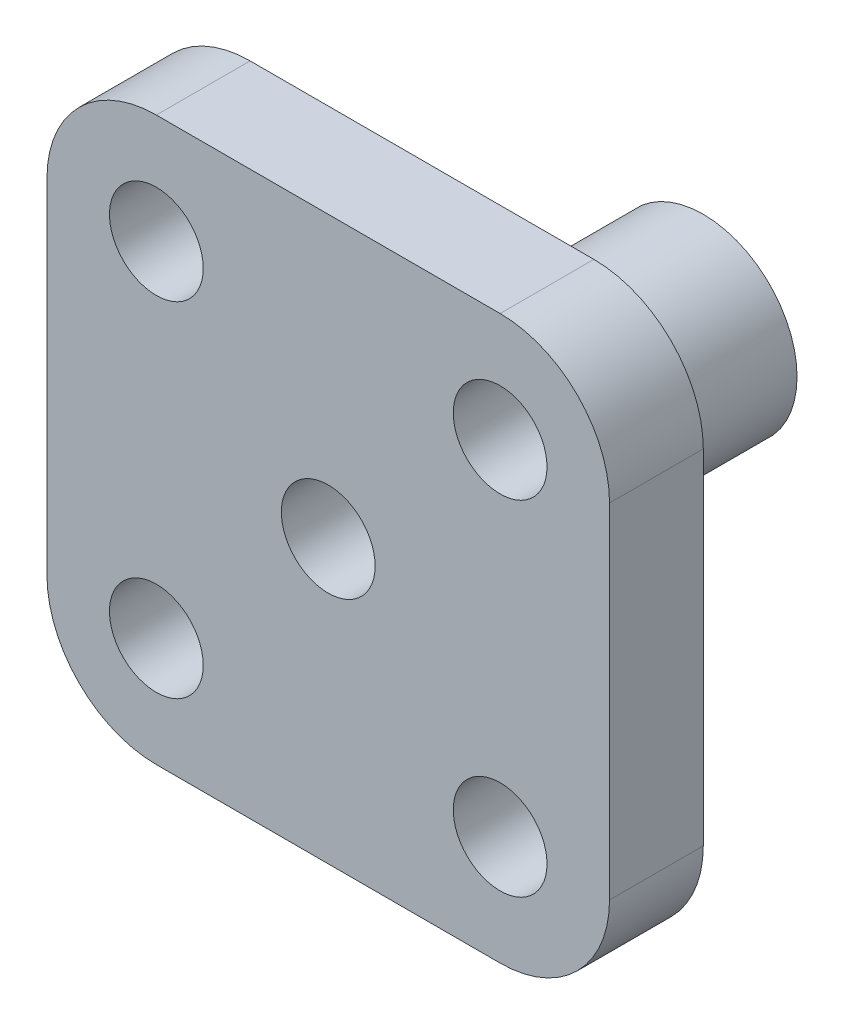
ISO-10303-21;
HEADER;
FILE_DESCRIPTION(('STEP AP214'),'2;1');
FILE_NAME('part.step','',(''),(''),'','','');
FILE_SCHEMA(('AUTOMOTIVE_DESIGN { 1 0 10303 214 1 1 1 1 }'));
ENDSEC;
DATA;
#1=APPLICATION_CONTEXT('core data for automotive mechanical design processes');
#2=APPLICATION_PROTOCOL_DEFINITION('international standard','automotive_design',2000,#1);
#3=PRODUCT_CONTEXT('',#1,'mechanical');
#4=PRODUCT('Part','Part','',(#3));
#5=PRODUCT_RELATED_PRODUCT_CATEGORY('part','',(#4));
#6=PRODUCT_DEFINITION_FORMATION('','',#4);
#7=PRODUCT_DEFINITION_CONTEXT('part definition',#1,'design');
#8=PRODUCT_DEFINITION('design','',#6,#7);
#9=PRODUCT_DEFINITION_SHAPE('','',#8);
#10=(LENGTH_UNIT() NAMED_UNIT(*) SI_UNIT(.MILLI.,.METRE.));
#11=(NAMED_UNIT(*) PLANE_ANGLE_UNIT() SI_UNIT($,.RADIAN.));
#12=(NAMED_UNIT(*) SI_UNIT($,.STERADIAN.) SOLID_ANGLE_UNIT());
#13=UNCERTAINTY_MEASURE_WITH_UNIT(LENGTH_MEASURE(1.E-05),#10,'distance_accuracy_value','');
#14=(GEOMETRIC_REPRESENTATION_CONTEXT(3) GLOBAL_UNCERTAINTY_ASSIGNED_CONTEXT((#13)) GLOBAL_UNIT_ASSIGNED_CONTEXT((#10,
#11,#12)) REPRESENTATION_CONTEXT('',''));
#15=CARTESIAN_POINT('',(0.,0.,0.));
#16=DIRECTION('',(0.,0.,1.));
#17=DIRECTION('',(1.,0.,0.));
#18=AXIS2_PLACEMENT_3D('',#15,#16,#17);
#19=CARTESIAN_POINT('',(0.,0.,-2.25));
#20=DIRECTION('',(0.,0.,1.));
#21=DIRECTION('',(1.,0.,0.));
#22=AXIS2_PLACEMENT_3D('',#19,#20,#21);
#23=PLANE('',#22);
#24=CARTESIAN_POINT('',(0.,0.,-2.25));
#25=DIRECTION('',(0.,0.,-1.));
#26=DIRECTION('',(-1.,0.,0.));
#27=AXIS2_PLACEMENT_3D('',#24,#25,#26);
#28=CIRCLE('',#27,0.65625);
#29=CARTESIAN_POINT('',(-0.65625,0.,-2.25));
#30=VERTEX_POINT('',#29);
#31=EDGE_CURVE('E214',#30,#30,#28,.T.);
#32=ORIENTED_EDGE('',*,*,#31,.F.);
#33=EDGE_LOOP('',(#32));
#34=FACE_BOUND('',#33,.T.);
#35=CARTESIAN_POINT('',(0.,0.,-2.25));
#36=DIRECTION('',(0.,0.,-1.));
#37=DIRECTION('',(-1.,0.,0.));
#38=AXIS2_PLACEMENT_3D('',#35,#36,#37);
#39=CIRCLE('',#38,0.75);
#40=CARTESIAN_POINT('',(-0.75,0.,-2.25));
#41=VERTEX_POINT('',#40);
#42=EDGE_CURVE('E135',#41,#41,#39,.T.);
#43=ORIENTED_EDGE('',*,*,#42,.T.);
#44=EDGE_LOOP('',(#43));
#45=FACE_BOUND('',#44,.T.);
#46=ADVANCED_FACE('F33',(#34,#45),#23,.F.);
#47=CARTESIAN_POINT('',(0.,0.,-2.88391304347826));
#48=DIRECTION('',(0.,0.,-1.));
#49=DIRECTION('',(-1.,0.,0.));
#50=AXIS2_PLACEMENT_3D('',#47,#48,#49);
#51=CYLINDRICAL_SURFACE('',#50,0.75);
#52=ORIENTED_EDGE('',*,*,#42,.F.);
#53=EDGE_LOOP('',(#52));
#54=FACE_BOUND('',#53,.T.);
#55=CARTESIAN_POINT('',(0.,0.,0.));
#56=DIRECTION('',(0.,0.,-1.));
#57=DIRECTION('',(-1.,0.,0.));
#58=AXIS2_PLACEMENT_3D('',#55,#56,#57);
#59=CIRCLE('',#58,0.75);
#60=CARTESIAN_POINT('',(-0.75,0.,0.));
#61=VERTEX_POINT('',#60);
#62=EDGE_CURVE('E132',#61,#61,#59,.T.);
#63=ORIENTED_EDGE('',*,*,#62,.T.);
#64=EDGE_LOOP('',(#63));
#65=FACE_BOUND('',#64,.T.);
#66=ADVANCED_FACE('F231',(#54,#65),#51,.T.);
#67=CARTESIAN_POINT('',(-2.25,-2.25,0.75));
#68=DIRECTION('',(1.,0.,0.));
#69=DIRECTION('',(0.,0.,-1.));
#70=AXIS2_PLACEMENT_3D('',#67,#68,#69);
#71=PLANE('',#70);
#72=DIRECTION('',(0.,-1.,0.));
#73=VECTOR('',#72,1.);
#74=CARTESIAN_POINT('',(-2.25,-2.25,0.));
#75=LINE('',#74,#73);
#76=CARTESIAN_POINT('',(-2.25,1.375,0.));
#77=VERTEX_POINT('',#76);
#78=CARTESIAN_POINT('',(-2.25,-1.375,0.));
#79=VERTEX_POINT('',#78);
#80=EDGE_CURVE('E128',#77,#79,#75,.T.);
#81=ORIENTED_EDGE('',*,*,#80,.T.);
#82=DIRECTION('',(0.,0.,-1.));
#83=VECTOR('',#82,1.);
#84=CARTESIAN_POINT('',(-2.25,-1.375,0.75));
#85=LINE('',#84,#83);
#86=CARTESIAN_POINT('',(-2.25,-1.375,0.75));
#87=VERTEX_POINT('',#86);
#88=EDGE_CURVE('E157',#79,#87,#85,.F.);
#89=ORIENTED_EDGE('',*,*,#88,.T.);
#90=DIRECTION('',(0.,-1.,0.));
#91=VECTOR('',#90,1.);
#92=CARTESIAN_POINT('',(-2.25,-2.25,0.75));
#93=LINE('',#92,#91);
#94=CARTESIAN_POINT('',(-2.25,1.375,0.75));
#95=VERTEX_POINT('',#94);
#96=EDGE_CURVE('E126',#95,#87,#93,.T.);
#97=ORIENTED_EDGE('',*,*,#96,.F.);
#98=DIRECTION('',(0.,0.,-1.));
#99=VECTOR('',#98,1.);
#100=CARTESIAN_POINT('',(-2.25,1.375,0.75));
#101=LINE('',#100,#99);
#102=EDGE_CURVE('E154',#95,#77,#101,.T.);
#103=ORIENTED_EDGE('',*,*,#102,.T.);
#104=EDGE_LOOP('',(#81,#89,#97,#103));
#105=FACE_BOUND('',#104,.T.);
#106=ADVANCED_FACE('F170',(#105),#71,.F.);
#107=CARTESIAN_POINT('',(2.25,-2.25,0.75));
#108=DIRECTION('',(0.,1.,0.));
#109=DIRECTION('',(-1.,0.,0.));
#110=AXIS2_PLACEMENT_3D('',#107,#108,#109);
#111=PLANE('',#110);
#112=DIRECTION('',(1.,0.,0.));
#113=VECTOR('',#112,1.);
#114=CARTESIAN_POINT('',(2.25,-2.25,0.));
#115=LINE('',#114,#113);
#116=CARTESIAN_POINT('',(-1.375,-2.25,0.));
#117=VERTEX_POINT('',#116);
#118=CARTESIAN_POINT('',(1.375,-2.25,0.));
#119=VERTEX_POINT('',#118);
#120=EDGE_CURVE('E124',#117,#119,#115,.T.);
#121=ORIENTED_EDGE('',*,*,#120,.T.);
#122=DIRECTION('',(0.,0.,-1.));
#123=VECTOR('',#122,1.);
#124=CARTESIAN_POINT('',(1.375,-2.25,0.75));
#125=LINE('',#124,#123);
#126=CARTESIAN_POINT('',(1.375,-2.25,0.75));
#127=VERTEX_POINT('',#126);
#128=EDGE_CURVE('E103',#119,#127,#125,.F.);
#129=ORIENTED_EDGE('',*,*,#128,.T.);
#130=DIRECTION('',(1.,0.,0.));
#131=VECTOR('',#130,1.);
#132=CARTESIAN_POINT('',(2.25,-2.25,0.75));
#133=LINE('',#132,#131);
#134=CARTESIAN_POINT('',(-1.375,-2.25,0.75));
#135=VERTEX_POINT('',#134);
#136=EDGE_CURVE('E174',#135,#127,#133,.T.);
#137=ORIENTED_EDGE('',*,*,#136,.F.);
#138=DIRECTION('',(0.,0.,-1.));
#139=VECTOR('',#138,1.);
#140=CARTESIAN_POINT('',(-1.375,-2.25,0.75));
#141=LINE('',#140,#139);
#142=EDGE_CURVE('E108',#135,#117,#141,.T.);
#143=ORIENTED_EDGE('',*,*,#142,.T.);
#144=EDGE_LOOP('',(#121,#129,#137,#143));
#145=FACE_BOUND('',#144,.T.);
#146=ADVANCED_FACE('F259',(#145),#111,.F.);
#147=CARTESIAN_POINT('',(2.25,-2.25,0.75));
#148=DIRECTION('',(-1.,0.,0.));
#149=DIRECTION('',(0.,0.,1.));
#150=AXIS2_PLACEMENT_3D('',#147,#148,#149);
#151=PLANE('',#150);
#152=DIRECTION('',(0.,1.,0.));
#153=VECTOR('',#152,1.);
#154=CARTESIAN_POINT('',(2.25,-2.25,0.75));
#155=LINE('',#154,#153);
#156=CARTESIAN_POINT('',(2.25,-1.375,0.75));
#157=VERTEX_POINT('',#156);
#158=CARTESIAN_POINT('',(2.25,1.375,0.75));
#159=VERTEX_POINT('',#158);
#160=EDGE_CURVE('E117',#157,#159,#155,.T.);
#161=ORIENTED_EDGE('',*,*,#160,.F.);
#162=DIRECTION('',(0.,0.,-1.));
#163=VECTOR('',#162,1.);
#164=CARTESIAN_POINT('',(2.25,-1.375,0.75));
#165=LINE('',#164,#163);
#166=CARTESIAN_POINT('',(2.25,-1.375,0.));
#167=VERTEX_POINT('',#166);
#168=EDGE_CURVE('E102',#157,#167,#165,.T.);
#169=ORIENTED_EDGE('',*,*,#168,.T.);
#170=DIRECTION('',(0.,1.,0.));
#171=VECTOR('',#170,1.);
#172=CARTESIAN_POINT('',(2.25,-2.25,0.));
#173=LINE('',#172,#171);
#174=CARTESIAN_POINT('',(2.25,1.375,0.));
#175=VERTEX_POINT('',#174);
#176=EDGE_CURVE('E115',#167,#175,#173,.T.);
#177=ORIENTED_EDGE('',*,*,#176,.T.);
#178=DIRECTION('',(0.,0.,-1.));
#179=VECTOR('',#178,1.);
#180=CARTESIAN_POINT('',(2.25,1.375,0.75));
#181=LINE('',#180,#179);
#182=EDGE_CURVE('E119',#175,#159,#181,.F.);
#183=ORIENTED_EDGE('',*,*,#182,.T.);
#184=EDGE_LOOP('',(#161,#169,#177,#183));
#185=FACE_BOUND('',#184,.T.);
#186=ADVANCED_FACE('F114',(#185),#151,.F.);
#187=CARTESIAN_POINT('',(2.25,2.25,0.75));
#188=DIRECTION('',(0.,-1.,0.));
#189=DIRECTION('',(1.,0.,0.));
#190=AXIS2_PLACEMENT_3D('',#187,#188,#189);
#191=PLANE('',#190);
#192=DIRECTION('',(-1.,0.,0.));
#193=VECTOR('',#192,1.);
#194=CARTESIAN_POINT('',(2.25,2.25,0.));
#195=LINE('',#194,#193);
#196=CARTESIAN_POINT('',(1.375,2.25,0.));
#197=VERTEX_POINT('',#196);
#198=CARTESIAN_POINT('',(-1.375,2.25,0.));
#199=VERTEX_POINT('',#198);
#200=EDGE_CURVE('E123',#197,#199,#195,.T.);
#201=ORIENTED_EDGE('',*,*,#200,.T.);
#202=DIRECTION('',(0.,0.,-1.));
#203=VECTOR('',#202,1.);
#204=CARTESIAN_POINT('',(-1.375,2.25,0.75));
#205=LINE('',#204,#203);
#206=CARTESIAN_POINT('',(-1.375,2.25,0.75));
#207=VERTEX_POINT('',#206);
#208=EDGE_CURVE('E11',#199,#207,#205,.F.);
#209=ORIENTED_EDGE('',*,*,#208,.T.);
#210=DIRECTION('',(-1.,0.,0.));
#211=VECTOR('',#210,1.);
#212=CARTESIAN_POINT('',(2.25,2.25,0.75));
#213=LINE('',#212,#211);
#214=CARTESIAN_POINT('',(1.375,2.25,0.75));
#215=VERTEX_POINT('',#214);
#216=EDGE_CURVE('E136',#215,#207,#213,.T.);
#217=ORIENTED_EDGE('',*,*,#216,.F.);
#218=DIRECTION('',(0.,0.,-1.));
#219=VECTOR('',#218,1.);
#220=CARTESIAN_POINT('',(1.375,2.25,0.75));
#221=LINE('',#220,#219);
#222=EDGE_CURVE('E41',#215,#197,#221,.T.);
#223=ORIENTED_EDGE('',*,*,#222,.T.);
#224=EDGE_LOOP('',(#201,#209,#217,#223));
#225=FACE_BOUND('',#224,.T.);
#226=ADVANCED_FACE('F160',(#225),#191,.F.);
#227=CARTESIAN_POINT('',(0.,0.,0.75));
#228=DIRECTION('',(0.,0.,1.));
#229=DIRECTION('',(1.,0.,0.));
#230=AXIS2_PLACEMENT_3D('',#227,#228,#229);
#231=PLANE('',#230);
#232=CARTESIAN_POINT('',(1.375,-1.375,0.75));
#233=DIRECTION('',(0.,0.,1.));
#234=DIRECTION('',(1.,0.,0.));
#235=AXIS2_PLACEMENT_3D('',#232,#233,#234);
#236=CIRCLE('',#235,0.375);
#237=CARTESIAN_POINT('',(1.75,-1.375,0.75));
#238=VERTEX_POINT('',#237);
#239=EDGE_CURVE('E193',#238,#238,#236,.T.);
#240=ORIENTED_EDGE('',*,*,#239,.F.);
#241=EDGE_LOOP('',(#240));
#242=FACE_BOUND('',#241,.T.);
#243=CARTESIAN_POINT('',(-1.375,-1.375,0.75));
#244=DIRECTION('',(0.,0.,1.));
#245=DIRECTION('',(1.,0.,0.));
#246=AXIS2_PLACEMENT_3D('',#243,#244,#245);
#247=CIRCLE('',#246,0.375);
#248=CARTESIAN_POINT('',(-1.,-1.375,0.75));
#249=VERTEX_POINT('',#248);
#250=EDGE_CURVE('E200',#249,#249,#247,.T.);
#251=ORIENTED_EDGE('',*,*,#250,.F.);
#252=EDGE_LOOP('',(#251));
#253=FACE_BOUND('',#252,.T.);
#254=CARTESIAN_POINT('',(0.,0.,0.75));
#255=DIRECTION('',(0.,0.,1.));
#256=DIRECTION('',(1.,0.,0.));
#257=AXIS2_PLACEMENT_3D('',#254,#255,#256);
#258=CIRCLE('',#257,0.375);
#259=CARTESIAN_POINT('',(0.375,0.,0.75));
#260=VERTEX_POINT('',#259);
#261=EDGE_CURVE('E203',#260,#260,#258,.T.);
#262=ORIENTED_EDGE('',*,*,#261,.F.);
#263=EDGE_LOOP('',(#262));
#264=FACE_BOUND('',#263,.T.);
#265=CARTESIAN_POINT('',(1.375,1.375,0.75));
#266=DIRECTION('',(0.,0.,1.));
#267=DIRECTION('',(1.,0.,0.));
#268=AXIS2_PLACEMENT_3D('',#265,#266,#267);
#269=CIRCLE('',#268,0.375);
#270=CARTESIAN_POINT('',(1.75,1.375,0.75));
#271=VERTEX_POINT('',#270);
#272=EDGE_CURVE('E188',#271,#271,#269,.T.);
#273=ORIENTED_EDGE('',*,*,#272,.F.);
#274=EDGE_LOOP('',(#273));
#275=FACE_BOUND('',#274,.T.);
#276=CARTESIAN_POINT('',(-1.375,1.375,0.75));
#277=DIRECTION('',(0.,0.,1.));
#278=DIRECTION('',(1.,0.,0.));
#279=AXIS2_PLACEMENT_3D('',#276,#277,#278);
#280=CIRCLE('',#279,0.375);
#281=CARTESIAN_POINT('',(-1.,1.375,0.75));
#282=VERTEX_POINT('',#281);
#283=EDGE_CURVE('E179',#282,#282,#280,.T.);
#284=ORIENTED_EDGE('',*,*,#283,.F.);
#285=EDGE_LOOP('',(#284));
#286=FACE_BOUND('',#285,.T.);
#287=ORIENTED_EDGE('',*,*,#136,.T.);
#288=CARTESIAN_POINT('',(1.375,-1.375,0.75));
#289=DIRECTION('',(0.,0.,1.));
#290=DIRECTION('',(1.,0.,0.));
#291=AXIS2_PLACEMENT_3D('',#288,#289,#290);
#292=CIRCLE('',#291,0.875);
#293=EDGE_CURVE('E152',#127,#157,#292,.T.);
#294=ORIENTED_EDGE('',*,*,#293,.T.);
#295=ORIENTED_EDGE('',*,*,#160,.T.);
#296=CARTESIAN_POINT('',(1.375,1.375,0.75));
#297=DIRECTION('',(0.,0.,1.));
#298=DIRECTION('',(1.,0.,0.));
#299=AXIS2_PLACEMENT_3D('',#296,#297,#298);
#300=CIRCLE('',#299,0.875);
#301=EDGE_CURVE('E53',#159,#215,#300,.T.);
#302=ORIENTED_EDGE('',*,*,#301,.T.);
#303=ORIENTED_EDGE('',*,*,#216,.T.);
#304=CARTESIAN_POINT('',(-1.375,1.375,0.75));
#305=DIRECTION('',(0.,0.,1.));
#306=DIRECTION('',(1.,0.,0.));
#307=AXIS2_PLACEMENT_3D('',#304,#305,#306);
#308=CIRCLE('',#307,0.875);
#309=EDGE_CURVE('E148',#207,#95,#308,.T.);
#310=ORIENTED_EDGE('',*,*,#309,.T.);
#311=ORIENTED_EDGE('',*,*,#96,.T.);
#312=CARTESIAN_POINT('',(-1.375,-1.375,0.75));
#313=DIRECTION('',(0.,0.,1.));
#314=DIRECTION('',(1.,0.,0.));
#315=AXIS2_PLACEMENT_3D('',#312,#313,#314);
#316=CIRCLE('',#315,0.875);
#317=EDGE_CURVE('E150',#87,#135,#316,.T.);
#318=ORIENTED_EDGE('',*,*,#317,.T.);
#319=EDGE_LOOP('',(#287,#294,#295,#302,#303,#310,#311,#318));
#320=FACE_BOUND('',#319,.T.);
#321=ADVANCED_FACE('F241',(#242,#253,#264,#275,#286,#320),#231,.T.);
#322=CARTESIAN_POINT('',(0.,0.,0.));
#323=DIRECTION('',(0.,0.,1.));
#324=DIRECTION('',(1.,0.,0.));
#325=AXIS2_PLACEMENT_3D('',#322,#323,#324);
#326=PLANE('',#325);
#327=CARTESIAN_POINT('',(1.375,-1.375,0.));
#328=DIRECTION('',(0.,0.,1.));
#329=DIRECTION('',(1.,0.,0.));
#330=AXIS2_PLACEMENT_3D('',#327,#328,#329);
#331=CIRCLE('',#330,0.375);
#332=CARTESIAN_POINT('',(1.75,-1.375,0.));
#333=VERTEX_POINT('',#332);
#334=EDGE_CURVE('E190',#333,#333,#331,.T.);
#335=ORIENTED_EDGE('',*,*,#334,.T.);
#336=EDGE_LOOP('',(#335));
#337=FACE_BOUND('',#336,.T.);
#338=CARTESIAN_POINT('',(-1.375,-1.375,0.));
#339=DIRECTION('',(0.,0.,1.));
#340=DIRECTION('',(1.,0.,0.));
#341=AXIS2_PLACEMENT_3D('',#338,#339,#340);
#342=CIRCLE('',#341,0.375);
#343=CARTESIAN_POINT('',(-1.,-1.375,0.));
#344=VERTEX_POINT('',#343);
#345=EDGE_CURVE('E197',#344,#344,#342,.T.);
#346=ORIENTED_EDGE('',*,*,#345,.T.);
#347=EDGE_LOOP('',(#346));
#348=FACE_BOUND('',#347,.T.);
#349=CARTESIAN_POINT('',(1.375,1.375,0.));
#350=DIRECTION('',(0.,0.,1.));
#351=DIRECTION('',(1.,0.,0.));
#352=AXIS2_PLACEMENT_3D('',#349,#350,#351);
#353=CIRCLE('',#352,0.375);
#354=CARTESIAN_POINT('',(1.75,1.375,0.));
#355=VERTEX_POINT('',#354);
#356=EDGE_CURVE('E209',#355,#355,#353,.T.);
#357=ORIENTED_EDGE('',*,*,#356,.T.);
#358=EDGE_LOOP('',(#357));
#359=FACE_BOUND('',#358,.T.);
#360=CARTESIAN_POINT('',(-1.375,1.375,0.));
#361=DIRECTION('',(0.,0.,1.));
#362=DIRECTION('',(1.,0.,0.));
#363=AXIS2_PLACEMENT_3D('',#360,#361,#362);
#364=CIRCLE('',#363,0.375);
#365=CARTESIAN_POINT('',(-1.,1.375,0.));
#366=VERTEX_POINT('',#365);
#367=EDGE_CURVE('E183',#366,#366,#364,.T.);
#368=ORIENTED_EDGE('',*,*,#367,.T.);
#369=EDGE_LOOP('',(#368));
#370=FACE_BOUND('',#369,.T.);
#371=ORIENTED_EDGE('',*,*,#62,.F.);
#372=EDGE_LOOP('',(#371));
#373=FACE_BOUND('',#372,.T.);
#374=ORIENTED_EDGE('',*,*,#176,.F.);
#375=CARTESIAN_POINT('',(1.375,-1.375,0.));
#376=DIRECTION('',(0.,0.,1.));
#377=DIRECTION('',(1.,0.,0.));
#378=AXIS2_PLACEMENT_3D('',#375,#376,#377);
#379=CIRCLE('',#378,0.875);
#380=EDGE_CURVE('E98',#167,#119,#379,.F.);
#381=ORIENTED_EDGE('',*,*,#380,.T.);
#382=ORIENTED_EDGE('',*,*,#120,.F.);
#383=CARTESIAN_POINT('',(-1.375,-1.375,0.));
#384=DIRECTION('',(0.,0.,1.));
#385=DIRECTION('',(1.,0.,0.));
#386=AXIS2_PLACEMENT_3D('',#383,#384,#385);
#387=CIRCLE('',#386,0.875);
#388=EDGE_CURVE('E109',#117,#79,#387,.F.);
#389=ORIENTED_EDGE('',*,*,#388,.T.);
#390=ORIENTED_EDGE('',*,*,#80,.F.);
#391=CARTESIAN_POINT('',(-1.375,1.375,0.));
#392=DIRECTION('',(0.,0.,1.));
#393=DIRECTION('',(1.,0.,0.));
#394=AXIS2_PLACEMENT_3D('',#391,#392,#393);
#395=CIRCLE('',#394,0.875);
#396=EDGE_CURVE('E141',#77,#199,#395,.F.);
#397=ORIENTED_EDGE('',*,*,#396,.T.);
#398=ORIENTED_EDGE('',*,*,#200,.F.);
#399=CARTESIAN_POINT('',(1.375,1.375,0.));
#400=DIRECTION('',(0.,0.,1.));
#401=DIRECTION('',(1.,0.,0.));
#402=AXIS2_PLACEMENT_3D('',#399,#400,#401);
#403=CIRCLE('',#402,0.875);
#404=EDGE_CURVE('E118',#197,#175,#403,.F.);
#405=ORIENTED_EDGE('',*,*,#404,.T.);
#406=EDGE_LOOP('',(#374,#381,#382,#389,#390,#397,#398,#405));
#407=FACE_BOUND('',#406,.T.);
#408=ADVANCED_FACE('F121',(#337,#348,#359,#370,#373,#407),#326,.F.);
#409=CARTESIAN_POINT('',(1.375,-1.375,0.75));
#410=DIRECTION('',(0.,0.,-1.));
#411=DIRECTION('',(-1.,0.,0.));
#412=AXIS2_PLACEMENT_3D('',#409,#410,#411);
#413=CYLINDRICAL_SURFACE('',#412,0.875);
#414=ORIENTED_EDGE('',*,*,#293,.F.);
#415=ORIENTED_EDGE('',*,*,#128,.F.);
#416=ORIENTED_EDGE('',*,*,#380,.F.);
#417=ORIENTED_EDGE('',*,*,#168,.F.);
#418=EDGE_LOOP('',(#414,#415,#416,#417));
#419=FACE_BOUND('',#418,.T.);
#420=ADVANCED_FACE('F101',(#419),#413,.T.);
#421=CARTESIAN_POINT('',(-1.375,-1.375,0.75));
#422=DIRECTION('',(0.,0.,-1.));
#423=DIRECTION('',(-1.,0.,0.));
#424=AXIS2_PLACEMENT_3D('',#421,#422,#423);
#425=CYLINDRICAL_SURFACE('',#424,0.875);
#426=ORIENTED_EDGE('',*,*,#317,.F.);
#427=ORIENTED_EDGE('',*,*,#88,.F.);
#428=ORIENTED_EDGE('',*,*,#388,.F.);
#429=ORIENTED_EDGE('',*,*,#142,.F.);
#430=EDGE_LOOP('',(#426,#427,#428,#429));
#431=FACE_BOUND('',#430,.T.);
#432=ADVANCED_FACE('F248',(#431),#425,.T.);
#433=CARTESIAN_POINT('',(-1.375,1.375,0.75));
#434=DIRECTION('',(0.,0.,-1.));
#435=DIRECTION('',(-1.,0.,0.));
#436=AXIS2_PLACEMENT_3D('',#433,#434,#435);
#437=CYLINDRICAL_SURFACE('',#436,0.875);
#438=ORIENTED_EDGE('',*,*,#309,.F.);
#439=ORIENTED_EDGE('',*,*,#208,.F.);
#440=ORIENTED_EDGE('',*,*,#396,.F.);
#441=ORIENTED_EDGE('',*,*,#102,.F.);
#442=EDGE_LOOP('',(#438,#439,#440,#441));
#443=FACE_BOUND('',#442,.T.);
#444=ADVANCED_FACE('F167',(#443),#437,.T.);
#445=CARTESIAN_POINT('',(1.375,1.375,0.75));
#446=DIRECTION('',(0.,0.,-1.));
#447=DIRECTION('',(-1.,0.,0.));
#448=AXIS2_PLACEMENT_3D('',#445,#446,#447);
#449=CYLINDRICAL_SURFACE('',#448,0.875);
#450=ORIENTED_EDGE('',*,*,#301,.F.);
#451=ORIENTED_EDGE('',*,*,#182,.F.);
#452=ORIENTED_EDGE('',*,*,#404,.F.);
#453=ORIENTED_EDGE('',*,*,#222,.F.);
#454=EDGE_LOOP('',(#450,#451,#452,#453));
#455=FACE_BOUND('',#454,.T.);
#456=ADVANCED_FACE('F35',(#455),#449,.T.);
#457=CARTESIAN_POINT('',(-1.375,1.375,0.));
#458=DIRECTION('',(0.,0.,1.));
#459=DIRECTION('',(1.,0.,0.));
#460=AXIS2_PLACEMENT_3D('',#457,#458,#459);
#461=CYLINDRICAL_SURFACE('',#460,0.375);
#462=ORIENTED_EDGE('',*,*,#367,.F.);
#463=EDGE_LOOP('',(#462));
#464=FACE_BOUND('',#463,.T.);
#465=ORIENTED_EDGE('',*,*,#283,.T.);
#466=EDGE_LOOP('',(#465));
#467=FACE_BOUND('',#466,.T.);
#468=ADVANCED_FACE('F271',(#464,#467),#461,.F.);
#469=CARTESIAN_POINT('',(1.375,1.375,0.));
#470=DIRECTION('',(0.,0.,1.));
#471=DIRECTION('',(1.,0.,0.));
#472=AXIS2_PLACEMENT_3D('',#469,#470,#471);
#473=CYLINDRICAL_SURFACE('',#472,0.375);
#474=ORIENTED_EDGE('',*,*,#356,.F.);
#475=EDGE_LOOP('',(#474));
#476=FACE_BOUND('',#475,.T.);
#477=ORIENTED_EDGE('',*,*,#272,.T.);
#478=EDGE_LOOP('',(#477));
#479=FACE_BOUND('',#478,.T.);
#480=ADVANCED_FACE('F275',(#476,#479),#473,.F.);
#481=CARTESIAN_POINT('',(-1.375,-1.375,0.));
#482=DIRECTION('',(0.,0.,1.));
#483=DIRECTION('',(1.,0.,0.));
#484=AXIS2_PLACEMENT_3D('',#481,#482,#483);
#485=CYLINDRICAL_SURFACE('',#484,0.375);
#486=ORIENTED_EDGE('',*,*,#345,.F.);
#487=EDGE_LOOP('',(#486));
#488=FACE_BOUND('',#487,.T.);
#489=ORIENTED_EDGE('',*,*,#250,.T.);
#490=EDGE_LOOP('',(#489));
#491=FACE_BOUND('',#490,.T.);
#492=ADVANCED_FACE('F282',(#488,#491),#485,.F.);
#493=CARTESIAN_POINT('',(1.375,-1.375,0.));
#494=DIRECTION('',(0.,0.,1.));
#495=DIRECTION('',(1.,0.,0.));
#496=AXIS2_PLACEMENT_3D('',#493,#494,#495);
#497=CYLINDRICAL_SURFACE('',#496,0.375);
#498=ORIENTED_EDGE('',*,*,#334,.F.);
#499=EDGE_LOOP('',(#498));
#500=FACE_BOUND('',#499,.T.);
#501=ORIENTED_EDGE('',*,*,#239,.T.);
#502=EDGE_LOOP('',(#501));
#503=FACE_BOUND('',#502,.T.);
#504=ADVANCED_FACE('F287',(#500,#503),#497,.F.);
#505=CARTESIAN_POINT('',(0.,0.,0.));
#506=DIRECTION('',(0.,0.,1.));
#507=DIRECTION('',(1.,0.,0.));
#508=AXIS2_PLACEMENT_3D('',#505,#506,#507);
#509=CYLINDRICAL_SURFACE('',#508,0.375);
#510=CARTESIAN_POINT('',(0.,0.,0.));
#511=DIRECTION('',(0.,0.,1.));
#512=DIRECTION('',(1.,0.,0.));
#513=AXIS2_PLACEMENT_3D('',#510,#511,#512);
#514=CIRCLE('',#513,0.375);
#515=CARTESIAN_POINT('',(0.375,0.,0.));
#516=VERTEX_POINT('',#515);
#517=EDGE_CURVE('E194',#516,#516,#514,.T.);
#518=ORIENTED_EDGE('',*,*,#517,.F.);
#519=EDGE_LOOP('',(#518));
#520=FACE_BOUND('',#519,.T.);
#521=ORIENTED_EDGE('',*,*,#261,.T.);
#522=EDGE_LOOP('',(#521));
#523=FACE_BOUND('',#522,.T.);
#524=ADVANCED_FACE('F290',(#520,#523),#509,.F.);
#525=CARTESIAN_POINT('',(0.,0.,0.));
#526=DIRECTION('',(0.,0.,-1.));
#527=DIRECTION('',(-1.,0.,0.));
#528=AXIS2_PLACEMENT_3D('',#525,#526,#527);
#529=PLANE('',#528);
#530=CARTESIAN_POINT('',(0.,0.,0.));
#531=DIRECTION('',(0.,0.,-1.));
#532=DIRECTION('',(-1.,0.,0.));
#533=AXIS2_PLACEMENT_3D('',#530,#531,#532);
#534=CIRCLE('',#533,0.65625);
#535=CARTESIAN_POINT('',(-0.65625,0.,0.));
#536=VERTEX_POINT('',#535);
#537=EDGE_CURVE('E206',#536,#536,#534,.T.);
#538=ORIENTED_EDGE('',*,*,#537,.T.);
#539=EDGE_LOOP('',(#538));
#540=FACE_BOUND('',#539,.T.);
#541=ORIENTED_EDGE('',*,*,#517,.T.);
#542=EDGE_LOOP('',(#541));
#543=FACE_BOUND('',#542,.T.);
#544=ADVANCED_FACE('F220',(#540,#543),#529,.T.);
#545=CARTESIAN_POINT('',(0.,0.,0.));
#546=DIRECTION('',(0.,0.,-1.));
#547=DIRECTION('',(-1.,0.,0.));
#548=AXIS2_PLACEMENT_3D('',#545,#546,#547);
#549=CYLINDRICAL_SURFACE('',#548,0.65625);
#550=ORIENTED_EDGE('',*,*,#537,.F.);
#551=EDGE_LOOP('',(#550));
#552=FACE_BOUND('',#551,.T.);
#553=ORIENTED_EDGE('',*,*,#31,.T.);
#554=EDGE_LOOP('',(#553));
#555=FACE_BOUND('',#554,.T.);
#556=ADVANCED_FACE('F223',(#552,#555),#549,.F.);
#557=CLOSED_SHELL('',(#46,#66,#106,#146,#186,#226,#321,#408,#420,#432,#444,#456,#468,#480,#492,
#504,#524,#544,#556));
#558=MANIFOLD_SOLID_BREP('B2',#557);
#559=ADVANCED_BREP_SHAPE_REPRESENTATION('',(#18,#558),#14);
#560=SHAPE_DEFINITION_REPRESENTATION(#9,#559);
ENDSEC;
END-ISO-10303-21;
